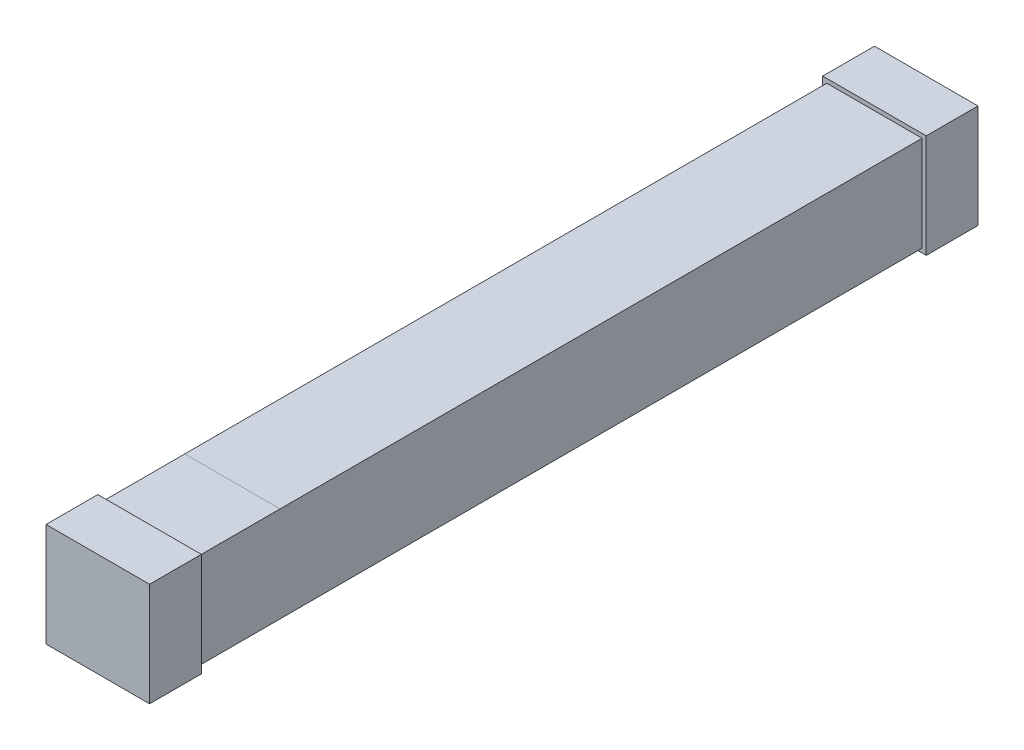
ISO-10303-21;
HEADER;
FILE_DESCRIPTION(('STEP AP214'),'2;1');
FILE_NAME('part.step','',(''),(''),'','','');
FILE_SCHEMA(('AUTOMOTIVE_DESIGN { 1 0 10303 214 1 1 1 1 }'));
ENDSEC;
DATA;
#1=APPLICATION_CONTEXT('core data for automotive mechanical design processes');
#2=APPLICATION_PROTOCOL_DEFINITION('international standard','automotive_design',2000,#1);
#3=PRODUCT_CONTEXT('',#1,'mechanical');
#4=PRODUCT('Part','Part','',(#3));
#5=PRODUCT_RELATED_PRODUCT_CATEGORY('part','',(#4));
#6=PRODUCT_DEFINITION_FORMATION('','',#4);
#7=PRODUCT_DEFINITION_CONTEXT('part definition',#1,'design');
#8=PRODUCT_DEFINITION('design','',#6,#7);
#9=PRODUCT_DEFINITION_SHAPE('','',#8);
#10=(LENGTH_UNIT() NAMED_UNIT(*) SI_UNIT(.MILLI.,.METRE.));
#11=(NAMED_UNIT(*) PLANE_ANGLE_UNIT() SI_UNIT($,.RADIAN.));
#12=(NAMED_UNIT(*) SI_UNIT($,.STERADIAN.) SOLID_ANGLE_UNIT());
#13=UNCERTAINTY_MEASURE_WITH_UNIT(LENGTH_MEASURE(1.E-05),#10,'distance_accuracy_value','');
#14=(GEOMETRIC_REPRESENTATION_CONTEXT(3) GLOBAL_UNCERTAINTY_ASSIGNED_CONTEXT((#13)) GLOBAL_UNIT_ASSIGNED_CONTEXT((#10,
#11,#12)) REPRESENTATION_CONTEXT('',''));
#15=CARTESIAN_POINT('',(0.,0.,0.));
#16=DIRECTION('',(0.,0.,1.));
#17=DIRECTION('',(1.,0.,0.));
#18=AXIS2_PLACEMENT_3D('',#15,#16,#17);
#19=CARTESIAN_POINT('',(-0.46,0.96,3.5));
#20=DIRECTION('',(0.,-1.,0.));
#21=DIRECTION('',(0.,0.,-1.));
#22=AXIS2_PLACEMENT_3D('',#19,#20,#21);
#23=PLANE('',#22);
#24=DIRECTION('',(-1.,0.,0.));
#25=VECTOR('',#24,1.);
#26=CARTESIAN_POINT('',(-0.46,0.96,2.7));
#27=LINE('',#26,#25);
#28=CARTESIAN_POINT('',(0.46,0.96,2.7));
#29=VERTEX_POINT('',#28);
#30=CARTESIAN_POINT('',(-0.46,0.96,2.7));
#31=VERTEX_POINT('',#30);
#32=EDGE_CURVE('E11',#29,#31,#27,.T.);
#33=ORIENTED_EDGE('',*,*,#32,.F.);
#34=DIRECTION('',(0.,0.,-1.));
#35=VECTOR('',#34,1.);
#36=CARTESIAN_POINT('',(0.46,0.96,3.5));
#37=LINE('',#36,#35);
#38=CARTESIAN_POINT('',(0.46,0.96,-3.5));
#39=VERTEX_POINT('',#38);
#40=EDGE_CURVE('E230',#29,#39,#37,.T.);
#41=ORIENTED_EDGE('',*,*,#40,.T.);
#42=DIRECTION('',(-1.,0.,0.));
#43=VECTOR('',#42,1.);
#44=CARTESIAN_POINT('',(-0.46,0.96,-3.5));
#45=LINE('',#44,#43);
#46=CARTESIAN_POINT('',(-0.46,0.96,-3.5));
#47=VERTEX_POINT('',#46);
#48=EDGE_CURVE('E207',#39,#47,#45,.T.);
#49=ORIENTED_EDGE('',*,*,#48,.T.);
#50=DIRECTION('',(0.,0.,-1.));
#51=VECTOR('',#50,1.);
#52=CARTESIAN_POINT('',(-0.46,0.96,3.5));
#53=LINE('',#52,#51);
#54=EDGE_CURVE('E216',#31,#47,#53,.T.);
#55=ORIENTED_EDGE('',*,*,#54,.F.);
#56=EDGE_LOOP('',(#33,#41,#49,#55));
#57=FACE_BOUND('',#56,.T.);
#58=ADVANCED_FACE('F37',(#57),#23,.F.);
#59=CARTESIAN_POINT('',(-0.46,0.96,3.5));
#60=DIRECTION('',(1.,0.,0.));
#61=DIRECTION('',(0.,1.,0.));
#62=AXIS2_PLACEMENT_3D('',#59,#60,#61);
#63=PLANE('',#62);
#64=DIRECTION('',(0.,-1.,0.));
#65=VECTOR('',#64,1.);
#66=CARTESIAN_POINT('',(-0.46,0.96,-3.5));
#67=LINE('',#66,#65);
#68=CARTESIAN_POINT('',(-0.46,0.04,-3.5));
#69=VERTEX_POINT('',#68);
#70=EDGE_CURVE('E202',#47,#69,#67,.T.);
#71=ORIENTED_EDGE('',*,*,#70,.T.);
#72=DIRECTION('',(0.,0.,-1.));
#73=VECTOR('',#72,1.);
#74=CARTESIAN_POINT('',(-0.46,0.04,3.5));
#75=LINE('',#74,#73);
#76=CARTESIAN_POINT('',(-0.46,0.04,3.5));
#77=VERTEX_POINT('',#76);
#78=EDGE_CURVE('E46',#77,#69,#75,.T.);
#79=ORIENTED_EDGE('',*,*,#78,.F.);
#80=DIRECTION('',(0.,-1.,0.));
#81=VECTOR('',#80,1.);
#82=CARTESIAN_POINT('',(-0.46,0.96,3.5));
#83=LINE('',#82,#81);
#84=CARTESIAN_POINT('',(-0.46,0.96,3.5));
#85=VERTEX_POINT('',#84);
#86=EDGE_CURVE('E203',#85,#77,#83,.T.);
#87=ORIENTED_EDGE('',*,*,#86,.F.);
#88=EDGE_CURVE('E227',#85,#31,#53,.T.);
#89=ORIENTED_EDGE('',*,*,#88,.T.);
#90=ORIENTED_EDGE('',*,*,#54,.T.);
#91=EDGE_LOOP('',(#71,#79,#87,#89,#90));
#92=FACE_BOUND('',#91,.T.);
#93=ADVANCED_FACE('F39',(#92),#63,.F.);
#94=CARTESIAN_POINT('',(-0.46,0.04,3.5));
#95=DIRECTION('',(0.,1.,0.));
#96=DIRECTION('',(-1.,0.,0.));
#97=AXIS2_PLACEMENT_3D('',#94,#95,#96);
#98=PLANE('',#97);
#99=DIRECTION('',(1.,0.,0.));
#100=VECTOR('',#99,1.);
#101=CARTESIAN_POINT('',(-0.46,0.04,-3.5));
#102=LINE('',#101,#100);
#103=CARTESIAN_POINT('',(0.46,0.04,-3.5));
#104=VERTEX_POINT('',#103);
#105=EDGE_CURVE('E219',#69,#104,#102,.T.);
#106=ORIENTED_EDGE('',*,*,#105,.T.);
#107=DIRECTION('',(0.,0.,-1.));
#108=VECTOR('',#107,1.);
#109=CARTESIAN_POINT('',(0.46,0.04,3.5));
#110=LINE('',#109,#108);
#111=CARTESIAN_POINT('',(0.46,0.04,3.5));
#112=VERTEX_POINT('',#111);
#113=EDGE_CURVE('E233',#112,#104,#110,.T.);
#114=ORIENTED_EDGE('',*,*,#113,.F.);
#115=DIRECTION('',(1.,0.,0.));
#116=VECTOR('',#115,1.);
#117=CARTESIAN_POINT('',(-0.46,0.04,3.5));
#118=LINE('',#117,#116);
#119=EDGE_CURVE('E206',#77,#112,#118,.T.);
#120=ORIENTED_EDGE('',*,*,#119,.F.);
#121=ORIENTED_EDGE('',*,*,#78,.T.);
#122=EDGE_LOOP('',(#106,#114,#120,#121));
#123=FACE_BOUND('',#122,.T.);
#124=ADVANCED_FACE('F238',(#123),#98,.F.);
#125=CARTESIAN_POINT('',(0.46,0.96,3.5));
#126=DIRECTION('',(-1.,0.,0.));
#127=DIRECTION('',(0.,-1.,0.));
#128=AXIS2_PLACEMENT_3D('',#125,#126,#127);
#129=PLANE('',#128);
#130=DIRECTION('',(0.,1.,0.));
#131=VECTOR('',#130,1.);
#132=CARTESIAN_POINT('',(0.46,0.96,-3.5));
#133=LINE('',#132,#131);
#134=EDGE_CURVE('E222',#104,#39,#133,.T.);
#135=ORIENTED_EDGE('',*,*,#134,.T.);
#136=ORIENTED_EDGE('',*,*,#40,.F.);
#137=CARTESIAN_POINT('',(0.46,0.96,3.5));
#138=VERTEX_POINT('',#137);
#139=EDGE_CURVE('E231',#138,#29,#37,.T.);
#140=ORIENTED_EDGE('',*,*,#139,.F.);
#141=DIRECTION('',(0.,1.,0.));
#142=VECTOR('',#141,1.);
#143=CARTESIAN_POINT('',(0.46,0.96,3.5));
#144=LINE('',#143,#142);
#145=EDGE_CURVE('E210',#112,#138,#144,.T.);
#146=ORIENTED_EDGE('',*,*,#145,.F.);
#147=ORIENTED_EDGE('',*,*,#113,.T.);
#148=EDGE_LOOP('',(#135,#136,#140,#146,#147));
#149=FACE_BOUND('',#148,.T.);
#150=ADVANCED_FACE('F245',(#149),#129,.F.);
#151=ORIENTED_EDGE('',*,*,#139,.T.);
#152=ORIENTED_EDGE('',*,*,#32,.T.);
#153=ORIENTED_EDGE('',*,*,#88,.F.);
#154=DIRECTION('',(-1.,0.,0.));
#155=VECTOR('',#154,1.);
#156=CARTESIAN_POINT('',(-0.46,0.96,3.5));
#157=LINE('',#156,#155);
#158=EDGE_CURVE('E213',#138,#85,#157,.T.);
#159=ORIENTED_EDGE('',*,*,#158,.F.);
#160=EDGE_LOOP('',(#151,#152,#153,#159));
#161=FACE_BOUND('',#160,.T.);
#162=ADVANCED_FACE('F248',(#161),#23,.F.);
#163=CARTESIAN_POINT('',(0.,0.,3.5));
#164=DIRECTION('',(0.,0.,1.));
#165=DIRECTION('',(1.,0.,0.));
#166=AXIS2_PLACEMENT_3D('',#163,#164,#165);
#167=PLANE('',#166);
#168=DIRECTION('',(1.,0.,0.));
#169=VECTOR('',#168,1.);
#170=CARTESIAN_POINT('',(-0.5,0.,3.5));
#171=LINE('',#170,#169);
#172=CARTESIAN_POINT('',(-0.5,0.,3.5));
#173=VERTEX_POINT('',#172);
#174=CARTESIAN_POINT('',(0.5,0.,3.5));
#175=VERTEX_POINT('',#174);
#176=EDGE_CURVE('E141',#173,#175,#171,.T.);
#177=ORIENTED_EDGE('',*,*,#176,.F.);
#178=DIRECTION('',(0.,-1.,0.));
#179=VECTOR('',#178,1.);
#180=CARTESIAN_POINT('',(-0.5,1.,3.5));
#181=LINE('',#180,#179);
#182=CARTESIAN_POINT('',(-0.5,1.,3.5));
#183=VERTEX_POINT('',#182);
#184=EDGE_CURVE('E177',#183,#173,#181,.T.);
#185=ORIENTED_EDGE('',*,*,#184,.F.);
#186=DIRECTION('',(-1.,0.,0.));
#187=VECTOR('',#186,1.);
#188=CARTESIAN_POINT('',(0.5,1.,3.5));
#189=LINE('',#188,#187);
#190=CARTESIAN_POINT('',(0.5,1.,3.5));
#191=VERTEX_POINT('',#190);
#192=EDGE_CURVE('E188',#191,#183,#189,.T.);
#193=ORIENTED_EDGE('',*,*,#192,.F.);
#194=DIRECTION('',(0.,1.,0.));
#195=VECTOR('',#194,1.);
#196=CARTESIAN_POINT('',(0.5,0.,3.5));
#197=LINE('',#196,#195);
#198=EDGE_CURVE('E186',#175,#191,#197,.T.);
#199=ORIENTED_EDGE('',*,*,#198,.F.);
#200=EDGE_LOOP('',(#177,#185,#193,#199));
#201=FACE_BOUND('',#200,.T.);
#202=ORIENTED_EDGE('',*,*,#158,.T.);
#203=ORIENTED_EDGE('',*,*,#86,.T.);
#204=ORIENTED_EDGE('',*,*,#119,.T.);
#205=ORIENTED_EDGE('',*,*,#145,.T.);
#206=EDGE_LOOP('',(#202,#203,#204,#205));
#207=FACE_BOUND('',#206,.T.);
#208=ADVANCED_FACE('F250',(#201,#207),#167,.F.);
#209=CARTESIAN_POINT('',(-0.5,0.,4.));
#210=DIRECTION('',(0.,1.,0.));
#211=DIRECTION('',(-1.,0.,0.));
#212=AXIS2_PLACEMENT_3D('',#209,#210,#211);
#213=PLANE('',#212);
#214=ORIENTED_EDGE('',*,*,#176,.T.);
#215=DIRECTION('',(0.,0.,-1.));
#216=VECTOR('',#215,1.);
#217=CARTESIAN_POINT('',(0.5,0.,4.));
#218=LINE('',#217,#216);
#219=CARTESIAN_POINT('',(0.5,0.,4.));
#220=VERTEX_POINT('',#219);
#221=EDGE_CURVE('E199',#220,#175,#218,.T.);
#222=ORIENTED_EDGE('',*,*,#221,.F.);
#223=DIRECTION('',(1.,0.,0.));
#224=VECTOR('',#223,1.);
#225=CARTESIAN_POINT('',(-0.5,0.,4.));
#226=LINE('',#225,#224);
#227=CARTESIAN_POINT('',(-0.5,0.,4.));
#228=VERTEX_POINT('',#227);
#229=EDGE_CURVE('E173',#228,#220,#226,.T.);
#230=ORIENTED_EDGE('',*,*,#229,.F.);
#231=DIRECTION('',(0.,0.,-1.));
#232=VECTOR('',#231,1.);
#233=CARTESIAN_POINT('',(-0.5,0.,4.));
#234=LINE('',#233,#232);
#235=EDGE_CURVE('E183',#228,#173,#234,.T.);
#236=ORIENTED_EDGE('',*,*,#235,.T.);
#237=EDGE_LOOP('',(#214,#222,#230,#236));
#238=FACE_BOUND('',#237,.T.);
#239=ADVANCED_FACE('F252',(#238),#213,.F.);
#240=CARTESIAN_POINT('',(0.5,0.,4.));
#241=DIRECTION('',(-1.,0.,0.));
#242=DIRECTION('',(0.,-1.,0.));
#243=AXIS2_PLACEMENT_3D('',#240,#241,#242);
#244=PLANE('',#243);
#245=ORIENTED_EDGE('',*,*,#198,.T.);
#246=DIRECTION('',(0.,0.,-1.));
#247=VECTOR('',#246,1.);
#248=CARTESIAN_POINT('',(0.5,1.,4.));
#249=LINE('',#248,#247);
#250=CARTESIAN_POINT('',(0.5,1.,4.));
#251=VERTEX_POINT('',#250);
#252=EDGE_CURVE('E196',#251,#191,#249,.T.);
#253=ORIENTED_EDGE('',*,*,#252,.F.);
#254=DIRECTION('',(0.,1.,0.));
#255=VECTOR('',#254,1.);
#256=CARTESIAN_POINT('',(0.5,0.,4.));
#257=LINE('',#256,#255);
#258=EDGE_CURVE('E176',#220,#251,#257,.T.);
#259=ORIENTED_EDGE('',*,*,#258,.F.);
#260=ORIENTED_EDGE('',*,*,#221,.T.);
#261=EDGE_LOOP('',(#245,#253,#259,#260));
#262=FACE_BOUND('',#261,.T.);
#263=ADVANCED_FACE('F260',(#262),#244,.F.);
#264=CARTESIAN_POINT('',(0.5,1.,4.));
#265=DIRECTION('',(0.,-1.,0.));
#266=DIRECTION('',(0.,0.,-1.));
#267=AXIS2_PLACEMENT_3D('',#264,#265,#266);
#268=PLANE('',#267);
#269=ORIENTED_EDGE('',*,*,#192,.T.);
#270=DIRECTION('',(0.,0.,-1.));
#271=VECTOR('',#270,1.);
#272=CARTESIAN_POINT('',(-0.5,1.,4.));
#273=LINE('',#272,#271);
#274=CARTESIAN_POINT('',(-0.5,1.,4.));
#275=VERTEX_POINT('',#274);
#276=EDGE_CURVE('E193',#275,#183,#273,.T.);
#277=ORIENTED_EDGE('',*,*,#276,.F.);
#278=DIRECTION('',(-1.,0.,0.));
#279=VECTOR('',#278,1.);
#280=CARTESIAN_POINT('',(0.5,1.,4.));
#281=LINE('',#280,#279);
#282=EDGE_CURVE('E179',#251,#275,#281,.T.);
#283=ORIENTED_EDGE('',*,*,#282,.F.);
#284=ORIENTED_EDGE('',*,*,#252,.T.);
#285=EDGE_LOOP('',(#269,#277,#283,#284));
#286=FACE_BOUND('',#285,.T.);
#287=ADVANCED_FACE('F373',(#286),#268,.F.);
#288=CARTESIAN_POINT('',(-0.5,1.,4.));
#289=DIRECTION('',(1.,0.,0.));
#290=DIRECTION('',(0.,1.,0.));
#291=AXIS2_PLACEMENT_3D('',#288,#289,#290);
#292=PLANE('',#291);
#293=ORIENTED_EDGE('',*,*,#184,.T.);
#294=ORIENTED_EDGE('',*,*,#235,.F.);
#295=DIRECTION('',(0.,-1.,0.));
#296=VECTOR('',#295,1.);
#297=CARTESIAN_POINT('',(-0.5,1.,4.));
#298=LINE('',#297,#296);
#299=EDGE_CURVE('E181',#275,#228,#298,.T.);
#300=ORIENTED_EDGE('',*,*,#299,.F.);
#301=ORIENTED_EDGE('',*,*,#276,.T.);
#302=EDGE_LOOP('',(#293,#294,#300,#301));
#303=FACE_BOUND('',#302,.T.);
#304=ADVANCED_FACE('F364',(#303),#292,.F.);
#305=CARTESIAN_POINT('',(0.,0.,4.));
#306=DIRECTION('',(0.,0.,1.));
#307=DIRECTION('',(1.,0.,0.));
#308=AXIS2_PLACEMENT_3D('',#305,#306,#307);
#309=PLANE('',#308);
#310=ORIENTED_EDGE('',*,*,#229,.T.);
#311=ORIENTED_EDGE('',*,*,#258,.T.);
#312=ORIENTED_EDGE('',*,*,#282,.T.);
#313=ORIENTED_EDGE('',*,*,#299,.T.);
#314=EDGE_LOOP('',(#310,#311,#312,#313));
#315=FACE_BOUND('',#314,.T.);
#316=ADVANCED_FACE('F356',(#315),#309,.T.);
#317=CARTESIAN_POINT('',(0.,0.,-3.5));
#318=DIRECTION('',(0.,0.,-1.));
#319=DIRECTION('',(1.,0.,0.));
#320=AXIS2_PLACEMENT_3D('',#317,#318,#319);
#321=PLANE('',#320);
#322=DIRECTION('',(1.,0.,0.));
#323=VECTOR('',#322,1.);
#324=CARTESIAN_POINT('',(-0.5,0.,-3.5));
#325=LINE('',#324,#323);
#326=CARTESIAN_POINT('',(-0.5,0.,-3.5));
#327=VERTEX_POINT('',#326);
#328=CARTESIAN_POINT('',(0.5,0.,-3.5));
#329=VERTEX_POINT('',#328);
#330=EDGE_CURVE('E136',#327,#329,#325,.T.);
#331=ORIENTED_EDGE('',*,*,#330,.T.);
#332=DIRECTION('',(0.,1.,0.));
#333=VECTOR('',#332,1.);
#334=CARTESIAN_POINT('',(0.5,0.,-3.5));
#335=LINE('',#334,#333);
#336=CARTESIAN_POINT('',(0.5,1.,-3.5));
#337=VERTEX_POINT('',#336);
#338=EDGE_CURVE('E152',#329,#337,#335,.T.);
#339=ORIENTED_EDGE('',*,*,#338,.T.);
#340=DIRECTION('',(-1.,0.,0.));
#341=VECTOR('',#340,1.);
#342=CARTESIAN_POINT('',(0.5,1.,-3.5));
#343=LINE('',#342,#341);
#344=CARTESIAN_POINT('',(-0.5,1.,-3.5));
#345=VERTEX_POINT('',#344);
#346=EDGE_CURVE('E164',#337,#345,#343,.T.);
#347=ORIENTED_EDGE('',*,*,#346,.T.);
#348=DIRECTION('',(0.,-1.,0.));
#349=VECTOR('',#348,1.);
#350=CARTESIAN_POINT('',(-0.5,1.,-3.5));
#351=LINE('',#350,#349);
#352=EDGE_CURVE('E162',#345,#327,#351,.T.);
#353=ORIENTED_EDGE('',*,*,#352,.T.);
#354=EDGE_LOOP('',(#331,#339,#347,#353));
#355=FACE_BOUND('',#354,.T.);
#356=ORIENTED_EDGE('',*,*,#105,.F.);
#357=ORIENTED_EDGE('',*,*,#70,.F.);
#358=ORIENTED_EDGE('',*,*,#48,.F.);
#359=ORIENTED_EDGE('',*,*,#134,.F.);
#360=EDGE_LOOP('',(#356,#357,#358,#359));
#361=FACE_BOUND('',#360,.T.);
#362=ADVANCED_FACE('F243',(#355,#361),#321,.F.);
#363=CARTESIAN_POINT('',(-0.5,0.,-4.));
#364=DIRECTION('',(0.,-1.,0.));
#365=DIRECTION('',(1.,0.,0.));
#366=AXIS2_PLACEMENT_3D('',#363,#364,#365);
#367=PLANE('',#366);
#368=ORIENTED_EDGE('',*,*,#330,.F.);
#369=DIRECTION('',(0.,0.,1.));
#370=VECTOR('',#369,1.);
#371=CARTESIAN_POINT('',(-0.5,0.,-4.));
#372=LINE('',#371,#370);
#373=CARTESIAN_POINT('',(-0.5,0.,-4.));
#374=VERTEX_POINT('',#373);
#375=EDGE_CURVE('E130',#374,#327,#372,.T.);
#376=ORIENTED_EDGE('',*,*,#375,.F.);
#377=DIRECTION('',(1.,0.,0.));
#378=VECTOR('',#377,1.);
#379=CARTESIAN_POINT('',(-0.5,0.,-4.));
#380=LINE('',#379,#378);
#381=CARTESIAN_POINT('',(0.5,0.,-4.));
#382=VERTEX_POINT('',#381);
#383=EDGE_CURVE('E133',#374,#382,#380,.T.);
#384=ORIENTED_EDGE('',*,*,#383,.T.);
#385=DIRECTION('',(0.,0.,1.));
#386=VECTOR('',#385,1.);
#387=CARTESIAN_POINT('',(0.5,0.,-4.));
#388=LINE('',#387,#386);
#389=EDGE_CURVE('E160',#382,#329,#388,.T.);
#390=ORIENTED_EDGE('',*,*,#389,.T.);
#391=EDGE_LOOP('',(#368,#376,#384,#390));
#392=FACE_BOUND('',#391,.T.);
#393=ADVANCED_FACE('F132',(#392),#367,.T.);
#394=CARTESIAN_POINT('',(-0.5,1.,-4.));
#395=DIRECTION('',(-1.,0.,0.));
#396=DIRECTION('',(0.,-1.,0.));
#397=AXIS2_PLACEMENT_3D('',#394,#395,#396);
#398=PLANE('',#397);
#399=ORIENTED_EDGE('',*,*,#352,.F.);
#400=DIRECTION('',(0.,0.,1.));
#401=VECTOR('',#400,1.);
#402=CARTESIAN_POINT('',(-0.5,1.,-4.));
#403=LINE('',#402,#401);
#404=CARTESIAN_POINT('',(-0.5,1.,-4.));
#405=VERTEX_POINT('',#404);
#406=EDGE_CURVE('E142',#405,#345,#403,.T.);
#407=ORIENTED_EDGE('',*,*,#406,.F.);
#408=DIRECTION('',(0.,-1.,0.));
#409=VECTOR('',#408,1.);
#410=CARTESIAN_POINT('',(-0.5,1.,-4.));
#411=LINE('',#410,#409);
#412=EDGE_CURVE('E148',#405,#374,#411,.T.);
#413=ORIENTED_EDGE('',*,*,#412,.T.);
#414=ORIENTED_EDGE('',*,*,#375,.T.);
#415=EDGE_LOOP('',(#399,#407,#413,#414));
#416=FACE_BOUND('',#415,.T.);
#417=ADVANCED_FACE('F154',(#416),#398,.T.);
#418=CARTESIAN_POINT('',(0.5,1.,-4.));
#419=DIRECTION('',(0.,1.,0.));
#420=DIRECTION('',(0.,0.,1.));
#421=AXIS2_PLACEMENT_3D('',#418,#419,#420);
#422=PLANE('',#421);
#423=ORIENTED_EDGE('',*,*,#346,.F.);
#424=DIRECTION('',(0.,0.,1.));
#425=VECTOR('',#424,1.);
#426=CARTESIAN_POINT('',(0.5,1.,-4.));
#427=LINE('',#426,#425);
#428=CARTESIAN_POINT('',(0.5,1.,-4.));
#429=VERTEX_POINT('',#428);
#430=EDGE_CURVE('E170',#429,#337,#427,.T.);
#431=ORIENTED_EDGE('',*,*,#430,.F.);
#432=DIRECTION('',(-1.,0.,0.));
#433=VECTOR('',#432,1.);
#434=CARTESIAN_POINT('',(0.5,1.,-4.));
#435=LINE('',#434,#433);
#436=EDGE_CURVE('E155',#429,#405,#435,.T.);
#437=ORIENTED_EDGE('',*,*,#436,.T.);
#438=ORIENTED_EDGE('',*,*,#406,.T.);
#439=EDGE_LOOP('',(#423,#431,#437,#438));
#440=FACE_BOUND('',#439,.T.);
#441=ADVANCED_FACE('F322',(#440),#422,.T.);
#442=CARTESIAN_POINT('',(0.5,0.,-4.));
#443=DIRECTION('',(1.,0.,0.));
#444=DIRECTION('',(0.,1.,0.));
#445=AXIS2_PLACEMENT_3D('',#442,#443,#444);
#446=PLANE('',#445);
#447=ORIENTED_EDGE('',*,*,#338,.F.);
#448=ORIENTED_EDGE('',*,*,#389,.F.);
#449=DIRECTION('',(0.,1.,0.));
#450=VECTOR('',#449,1.);
#451=CARTESIAN_POINT('',(0.5,0.,-4.));
#452=LINE('',#451,#450);
#453=EDGE_CURVE('E151',#382,#429,#452,.T.);
#454=ORIENTED_EDGE('',*,*,#453,.T.);
#455=ORIENTED_EDGE('',*,*,#430,.T.);
#456=EDGE_LOOP('',(#447,#448,#454,#455));
#457=FACE_BOUND('',#456,.T.);
#458=ADVANCED_FACE('F314',(#457),#446,.T.);
#459=CARTESIAN_POINT('',(0.,0.,-4.));
#460=DIRECTION('',(0.,0.,-1.));
#461=DIRECTION('',(1.,0.,0.));
#462=AXIS2_PLACEMENT_3D('',#459,#460,#461);
#463=PLANE('',#462);
#464=ORIENTED_EDGE('',*,*,#383,.F.);
#465=ORIENTED_EDGE('',*,*,#412,.F.);
#466=ORIENTED_EDGE('',*,*,#436,.F.);
#467=ORIENTED_EDGE('',*,*,#453,.F.);
#468=EDGE_LOOP('',(#464,#465,#466,#467));
#469=FACE_BOUND('',#468,.T.);
#470=ADVANCED_FACE('F146',(#469),#463,.T.);
#471=CLOSED_SHELL('',(#58,#93,#124,#150,#162,#208,#239,#263,#287,#304,#316,#362,#393,#417,#441,
#458,#470));
#472=MANIFOLD_SOLID_BREP('B2',#471);
#473=ADVANCED_BREP_SHAPE_REPRESENTATION('',(#18,#472),#14);
#474=SHAPE_DEFINITION_REPRESENTATION(#9,#473);
ENDSEC;
END-ISO-10303-21;
